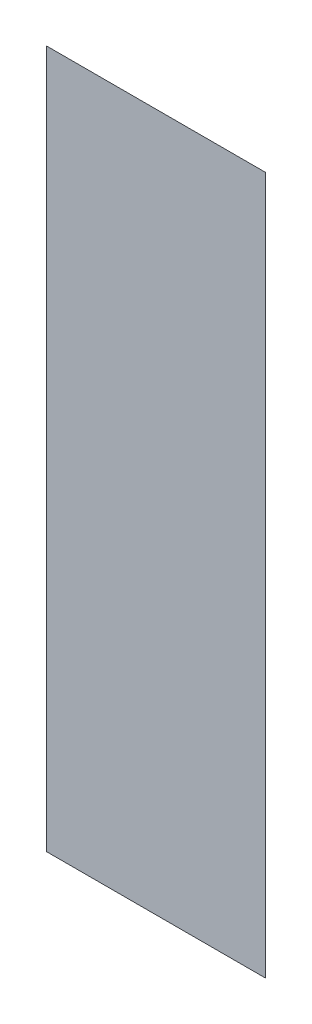
ISO-10303-21;
HEADER;
FILE_DESCRIPTION(('STEP AP214'),'2;1');
FILE_NAME('part.step','',(''),(''),'','','');
FILE_SCHEMA(('AUTOMOTIVE_DESIGN { 1 0 10303 214 1 1 1 1 }'));
ENDSEC;
DATA;
#1=APPLICATION_CONTEXT('core data for automotive mechanical design processes');
#2=APPLICATION_PROTOCOL_DEFINITION('international standard','automotive_design',2000,#1);
#3=PRODUCT_CONTEXT('',#1,'mechanical');
#4=PRODUCT('Part','Part','',(#3));
#5=PRODUCT_RELATED_PRODUCT_CATEGORY('part','',(#4));
#6=PRODUCT_DEFINITION_FORMATION('','',#4);
#7=PRODUCT_DEFINITION_CONTEXT('part definition',#1,'design');
#8=PRODUCT_DEFINITION('design','',#6,#7);
#9=PRODUCT_DEFINITION_SHAPE('','',#8);
#10=(LENGTH_UNIT() NAMED_UNIT(*) SI_UNIT(.MILLI.,.METRE.));
#11=(NAMED_UNIT(*) PLANE_ANGLE_UNIT() SI_UNIT($,.RADIAN.));
#12=(NAMED_UNIT(*) SI_UNIT($,.STERADIAN.) SOLID_ANGLE_UNIT());
#13=UNCERTAINTY_MEASURE_WITH_UNIT(LENGTH_MEASURE(1.E-05),#10,'distance_accuracy_value','');
#14=(GEOMETRIC_REPRESENTATION_CONTEXT(3) GLOBAL_UNCERTAINTY_ASSIGNED_CONTEXT((#13)) GLOBAL_UNIT_ASSIGNED_CONTEXT((#10,
#11,#12)) REPRESENTATION_CONTEXT('',''));
#15=CARTESIAN_POINT('',(0.,0.,0.));
#16=DIRECTION('',(0.,0.,1.));
#17=DIRECTION('',(1.,0.,0.));
#18=AXIS2_PLACEMENT_3D('',#15,#16,#17);
#19=CARTESIAN_POINT('',(6.11196058812,0.781684481396,0.001668));
#20=DIRECTION('',(0.,0.,1.));
#21=DIRECTION('',(1.,0.,0.));
#22=AXIS2_PLACEMENT_3D('',#19,#20,#21);
#23=PLANE('',#22);
#24=CARTESIAN_POINT('',(6.083179879326,0.873512666637,0.001668));
#25=DIRECTION('',(0.,-1.,0.));
#26=VECTOR('',#25,1.);
#27=LINE('',#24,#26);
#28=CARTESIAN_POINT('',(6.083179879326,0.873512666637,0.0015));
#29=VERTEX_POINT('',#28);
#30=CARTESIAN_POINT('',(6.083179879326,0.689856296154,0.0015));
#31=VERTEX_POINT('',#30);
#32=EDGE_CURVE('E41',#29,#31,#27,.T.);
#33=ORIENTED_EDGE('',*,*,#32,.T.);
#34=CARTESIAN_POINT('',(6.083179879326,0.689856296154,0.001668));
#35=DIRECTION('',(1.,0.,0.));
#36=VECTOR('',#35,1.);
#37=LINE('',#34,#36);
#38=CARTESIAN_POINT('',(6.140741296913,0.689856296154,0.0015));
#39=VERTEX_POINT('',#38);
#40=EDGE_CURVE('E28',#31,#39,#37,.T.);
#41=ORIENTED_EDGE('',*,*,#40,.T.);
#42=CARTESIAN_POINT('',(6.140741296913,0.689856296154,0.001668));
#43=DIRECTION('',(0.,1.,0.));
#44=VECTOR('',#43,1.);
#45=LINE('',#42,#44);
#46=CARTESIAN_POINT('',(6.140741296913,0.873512666637,0.0015));
#47=VERTEX_POINT('',#46);
#48=EDGE_CURVE('E11',#39,#47,#45,.T.);
#49=ORIENTED_EDGE('',*,*,#48,.T.);
#50=CARTESIAN_POINT('',(6.140741296913,0.873512666637,0.001668));
#51=DIRECTION('',(-1.,0.,0.));
#52=VECTOR('',#51,1.);
#53=LINE('',#50,#52);
#54=EDGE_CURVE('E44',#47,#29,#53,.T.);
#55=ORIENTED_EDGE('',*,*,#54,.T.);
#56=EDGE_LOOP('',(#33,#41,#49,#55));
#57=FACE_BOUND('',#56,.T.);
#58=ADVANCED_FACE('F17',(#57),#23,.T.);
#59=CARTESIAN_POINT('',(6.11196058812,0.781684481396,0.001332));
#60=DIRECTION('',(0.,0.,1.));
#61=DIRECTION('',(1.,0.,0.));
#62=AXIS2_PLACEMENT_3D('',#59,#60,#61);
#63=PLANE('',#62);
#64=ORIENTED_EDGE('',*,*,#40,.F.);
#65=ORIENTED_EDGE('',*,*,#32,.F.);
#66=ORIENTED_EDGE('',*,*,#54,.F.);
#67=ORIENTED_EDGE('',*,*,#48,.F.);
#68=EDGE_LOOP('',(#64,#65,#66,#67));
#69=FACE_BOUND('',#68,.T.);
#70=ADVANCED_FACE('F46',(#69),#63,.F.);
#71=CLOSED_SHELL('',(#58,#70));
#72=MANIFOLD_SOLID_BREP('B1',#71);
#73=ADVANCED_BREP_SHAPE_REPRESENTATION('',(#18,#72),#14);
#74=SHAPE_DEFINITION_REPRESENTATION(#9,#73);
ENDSEC;
END-ISO-10303-21;
